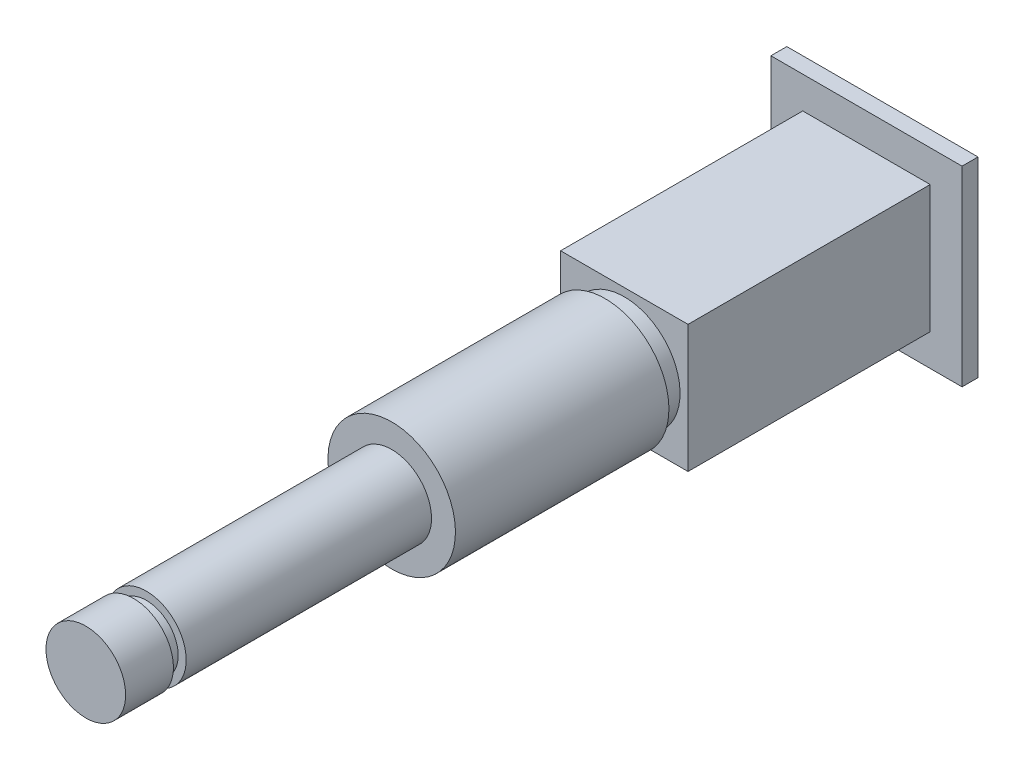
ISO-10303-21;
HEADER;
FILE_DESCRIPTION(('STEP AP214'),'2;1');
FILE_NAME('part.step','',(''),(''),'','','');
FILE_SCHEMA(('AUTOMOTIVE_DESIGN { 1 0 10303 214 1 1 1 1 }'));
ENDSEC;
DATA;
#1=APPLICATION_CONTEXT('core data for automotive mechanical design processes');
#2=APPLICATION_PROTOCOL_DEFINITION('international standard','automotive_design',2000,#1);
#3=PRODUCT_CONTEXT('',#1,'mechanical');
#4=PRODUCT('Part','Part','',(#3));
#5=PRODUCT_RELATED_PRODUCT_CATEGORY('part','',(#4));
#6=PRODUCT_DEFINITION_FORMATION('','',#4);
#7=PRODUCT_DEFINITION_CONTEXT('part definition',#1,'design');
#8=PRODUCT_DEFINITION('design','',#6,#7);
#9=PRODUCT_DEFINITION_SHAPE('','',#8);
#10=(LENGTH_UNIT() NAMED_UNIT(*) SI_UNIT(.MILLI.,.METRE.));
#11=(NAMED_UNIT(*) PLANE_ANGLE_UNIT() SI_UNIT($,.RADIAN.));
#12=(NAMED_UNIT(*) SI_UNIT($,.STERADIAN.) SOLID_ANGLE_UNIT());
#13=UNCERTAINTY_MEASURE_WITH_UNIT(LENGTH_MEASURE(1.E-05),#10,'distance_accuracy_value','');
#14=(GEOMETRIC_REPRESENTATION_CONTEXT(3) GLOBAL_UNCERTAINTY_ASSIGNED_CONTEXT((#13)) GLOBAL_UNIT_ASSIGNED_CONTEXT((#10,
#11,#12)) REPRESENTATION_CONTEXT('',''));
#15=CARTESIAN_POINT('',(0.,0.,0.));
#16=DIRECTION('',(0.,0.,1.));
#17=DIRECTION('',(1.,0.,0.));
#18=AXIS2_PLACEMENT_3D('',#15,#16,#17);
#19=CARTESIAN_POINT('',(0.,0.,19.2));
#20=DIRECTION('',(0.,0.,-1.));
#21=DIRECTION('',(0.,1.,0.));
#22=AXIS2_PLACEMENT_3D('',#19,#20,#21);
#23=PLANE('',#22);
#24=CARTESIAN_POINT('',(0.,0.,19.2));
#25=DIRECTION('',(0.,0.,1.));
#26=DIRECTION('',(0.,-1.,0.));
#27=AXIS2_PLACEMENT_3D('',#24,#25,#26);
#28=CIRCLE('',#27,2.5);
#29=CARTESIAN_POINT('',(0.,-2.5,19.2));
#30=VERTEX_POINT('',#29);
#31=EDGE_CURVE('E11',#30,#30,#28,.T.);
#32=ORIENTED_EDGE('',*,*,#31,.T.);
#33=EDGE_LOOP('',(#32));
#34=FACE_BOUND('',#33,.T.);
#35=ADVANCED_FACE('F37',(#34),#23,.F.);
#36=CARTESIAN_POINT('',(0.,0.,19.2));
#37=DIRECTION('',(0.,0.,1.));
#38=DIRECTION('',(0.,-1.,0.));
#39=AXIS2_PLACEMENT_3D('',#36,#37,#38);
#40=CYLINDRICAL_SURFACE('',#39,2.5);
#41=ORIENTED_EDGE('',*,*,#31,.F.);
#42=EDGE_LOOP('',(#41));
#43=FACE_BOUND('',#42,.T.);
#44=CARTESIAN_POINT('',(0.,0.,16.2));
#45=DIRECTION('',(0.,0.,1.));
#46=DIRECTION('',(0.,-1.,0.));
#47=AXIS2_PLACEMENT_3D('',#44,#45,#46);
#48=CIRCLE('',#47,2.5);
#49=CARTESIAN_POINT('',(0.,-2.5,16.2));
#50=VERTEX_POINT('',#49);
#51=EDGE_CURVE('E44',#50,#50,#48,.T.);
#52=ORIENTED_EDGE('',*,*,#51,.T.);
#53=EDGE_LOOP('',(#52));
#54=FACE_BOUND('',#53,.T.);
#55=ADVANCED_FACE('F194',(#43,#54),#40,.T.);
#56=CARTESIAN_POINT('',(0.,2.,16.2));
#57=DIRECTION('',(0.,0.,1.));
#58=DIRECTION('',(0.,-1.,0.));
#59=AXIS2_PLACEMENT_3D('',#56,#57,#58);
#60=PLANE('',#59);
#61=ORIENTED_EDGE('',*,*,#51,.F.);
#62=EDGE_LOOP('',(#61));
#63=FACE_BOUND('',#62,.T.);
#64=CARTESIAN_POINT('',(0.,0.,16.2));
#65=DIRECTION('',(0.,0.,1.));
#66=DIRECTION('',(0.,-1.,0.));
#67=AXIS2_PLACEMENT_3D('',#64,#65,#66);
#68=CIRCLE('',#67,2.);
#69=CARTESIAN_POINT('',(0.,-2.,16.2));
#70=VERTEX_POINT('',#69);
#71=EDGE_CURVE('E189',#70,#70,#68,.T.);
#72=ORIENTED_EDGE('',*,*,#71,.T.);
#73=EDGE_LOOP('',(#72));
#74=FACE_BOUND('',#73,.T.);
#75=ADVANCED_FACE('F196',(#63,#74),#60,.F.);
#76=CARTESIAN_POINT('',(0.,0.,19.2));
#77=DIRECTION('',(0.,0.,1.));
#78=DIRECTION('',(0.,-1.,0.));
#79=AXIS2_PLACEMENT_3D('',#76,#77,#78);
#80=CYLINDRICAL_SURFACE('',#79,2.);
#81=ORIENTED_EDGE('',*,*,#71,.F.);
#82=EDGE_LOOP('',(#81));
#83=FACE_BOUND('',#82,.T.);
#84=CARTESIAN_POINT('',(0.,0.,15.4));
#85=DIRECTION('',(0.,0.,1.));
#86=DIRECTION('',(0.,-1.,0.));
#87=AXIS2_PLACEMENT_3D('',#84,#85,#86);
#88=CIRCLE('',#87,2.);
#89=CARTESIAN_POINT('',(0.,-2.,15.4));
#90=VERTEX_POINT('',#89);
#91=EDGE_CURVE('E186',#90,#90,#88,.T.);
#92=ORIENTED_EDGE('',*,*,#91,.T.);
#93=EDGE_LOOP('',(#92));
#94=FACE_BOUND('',#93,.T.);
#95=ADVANCED_FACE('F199',(#83,#94),#80,.T.);
#96=CARTESIAN_POINT('',(0.,2.5,15.4));
#97=DIRECTION('',(0.,0.,-1.));
#98=DIRECTION('',(0.,1.,0.));
#99=AXIS2_PLACEMENT_3D('',#96,#97,#98);
#100=PLANE('',#99);
#101=ORIENTED_EDGE('',*,*,#91,.F.);
#102=EDGE_LOOP('',(#101));
#103=FACE_BOUND('',#102,.T.);
#104=CARTESIAN_POINT('',(0.,0.,15.4));
#105=DIRECTION('',(0.,0.,1.));
#106=DIRECTION('',(0.,-1.,0.));
#107=AXIS2_PLACEMENT_3D('',#104,#105,#106);
#108=CIRCLE('',#107,2.5);
#109=CARTESIAN_POINT('',(0.,-2.5,15.4));
#110=VERTEX_POINT('',#109);
#111=EDGE_CURVE('E183',#110,#110,#108,.T.);
#112=ORIENTED_EDGE('',*,*,#111,.T.);
#113=EDGE_LOOP('',(#112));
#114=FACE_BOUND('',#113,.T.);
#115=ADVANCED_FACE('F205',(#103,#114),#100,.F.);
#116=CARTESIAN_POINT('',(0.,0.,19.2));
#117=DIRECTION('',(0.,0.,1.));
#118=DIRECTION('',(0.,-1.,0.));
#119=AXIS2_PLACEMENT_3D('',#116,#117,#118);
#120=CYLINDRICAL_SURFACE('',#119,2.5);
#121=ORIENTED_EDGE('',*,*,#111,.F.);
#122=EDGE_LOOP('',(#121));
#123=FACE_BOUND('',#122,.T.);
#124=CARTESIAN_POINT('',(0.,0.,0.));
#125=DIRECTION('',(0.,0.,1.));
#126=DIRECTION('',(0.,-1.,0.));
#127=AXIS2_PLACEMENT_3D('',#124,#125,#126);
#128=CIRCLE('',#127,2.5);
#129=CARTESIAN_POINT('',(0.,-2.5,0.));
#130=VERTEX_POINT('',#129);
#131=EDGE_CURVE('E180',#130,#130,#128,.T.);
#132=ORIENTED_EDGE('',*,*,#131,.T.);
#133=EDGE_LOOP('',(#132));
#134=FACE_BOUND('',#133,.T.);
#135=ADVANCED_FACE('F211',(#123,#134),#120,.T.);
#136=CARTESIAN_POINT('',(0.,2.5,0.));
#137=DIRECTION('',(0.,0.,-1.));
#138=DIRECTION('',(0.,1.,0.));
#139=AXIS2_PLACEMENT_3D('',#136,#137,#138);
#140=PLANE('',#139);
#141=ORIENTED_EDGE('',*,*,#131,.F.);
#142=EDGE_LOOP('',(#141));
#143=FACE_BOUND('',#142,.T.);
#144=CARTESIAN_POINT('',(0.,0.,0.));
#145=DIRECTION('',(0.,0.,1.));
#146=DIRECTION('',(0.,-1.,0.));
#147=AXIS2_PLACEMENT_3D('',#144,#145,#146);
#148=CIRCLE('',#147,4.);
#149=CARTESIAN_POINT('',(0.,-4.,0.));
#150=VERTEX_POINT('',#149);
#151=EDGE_CURVE('E177',#150,#150,#148,.T.);
#152=ORIENTED_EDGE('',*,*,#151,.T.);
#153=EDGE_LOOP('',(#152));
#154=FACE_BOUND('',#153,.T.);
#155=ADVANCED_FACE('F217',(#143,#154),#140,.F.);
#156=CARTESIAN_POINT('',(0.,0.,19.2));
#157=DIRECTION('',(0.,0.,1.));
#158=DIRECTION('',(0.,-1.,0.));
#159=AXIS2_PLACEMENT_3D('',#156,#157,#158);
#160=CYLINDRICAL_SURFACE('',#159,4.);
#161=ORIENTED_EDGE('',*,*,#151,.F.);
#162=EDGE_LOOP('',(#161));
#163=FACE_BOUND('',#162,.T.);
#164=CARTESIAN_POINT('',(0.,0.,-13.4));
#165=DIRECTION('',(0.,0.,1.));
#166=DIRECTION('',(0.,-1.,0.));
#167=AXIS2_PLACEMENT_3D('',#164,#165,#166);
#168=CIRCLE('',#167,4.);
#169=CARTESIAN_POINT('',(0.,-4.,-13.4));
#170=VERTEX_POINT('',#169);
#171=EDGE_CURVE('E174',#170,#170,#168,.T.);
#172=ORIENTED_EDGE('',*,*,#171,.T.);
#173=EDGE_LOOP('',(#172));
#174=FACE_BOUND('',#173,.T.);
#175=ADVANCED_FACE('F223',(#163,#174),#160,.T.);
#176=CARTESIAN_POINT('',(0.,3.5,-13.4));
#177=DIRECTION('',(0.,0.,1.));
#178=DIRECTION('',(0.,-1.,0.));
#179=AXIS2_PLACEMENT_3D('',#176,#177,#178);
#180=PLANE('',#179);
#181=ORIENTED_EDGE('',*,*,#171,.F.);
#182=EDGE_LOOP('',(#181));
#183=FACE_BOUND('',#182,.T.);
#184=CARTESIAN_POINT('',(0.,0.,-13.4));
#185=DIRECTION('',(0.,0.,1.));
#186=DIRECTION('',(0.,-1.,0.));
#187=AXIS2_PLACEMENT_3D('',#184,#185,#186);
#188=CIRCLE('',#187,3.5);
#189=CARTESIAN_POINT('',(0.,-3.5,-13.4));
#190=VERTEX_POINT('',#189);
#191=EDGE_CURVE('E171',#190,#190,#188,.T.);
#192=ORIENTED_EDGE('',*,*,#191,.T.);
#193=EDGE_LOOP('',(#192));
#194=FACE_BOUND('',#193,.T.);
#195=ADVANCED_FACE('F229',(#183,#194),#180,.F.);
#196=CARTESIAN_POINT('',(0.,0.,19.2));
#197=DIRECTION('',(0.,0.,1.));
#198=DIRECTION('',(0.,-1.,0.));
#199=AXIS2_PLACEMENT_3D('',#196,#197,#198);
#200=CYLINDRICAL_SURFACE('',#199,3.5);
#201=ORIENTED_EDGE('',*,*,#191,.F.);
#202=EDGE_LOOP('',(#201));
#203=FACE_BOUND('',#202,.T.);
#204=CARTESIAN_POINT('',(0.,0.,-14.6));
#205=DIRECTION('',(0.,0.,1.));
#206=DIRECTION('',(0.,-1.,0.));
#207=AXIS2_PLACEMENT_3D('',#204,#205,#206);
#208=CIRCLE('',#207,3.5);
#209=CARTESIAN_POINT('',(0.,-3.5,-14.6));
#210=VERTEX_POINT('',#209);
#211=EDGE_CURVE('E145',#210,#210,#208,.T.);
#212=ORIENTED_EDGE('',*,*,#211,.T.);
#213=EDGE_LOOP('',(#212));
#214=FACE_BOUND('',#213,.T.);
#215=ADVANCED_FACE('F235',(#203,#214),#200,.T.);
#216=CARTESIAN_POINT('',(0.,4.,-14.6));
#217=DIRECTION('',(0.,0.,-1.));
#218=DIRECTION('',(0.,1.,0.));
#219=AXIS2_PLACEMENT_3D('',#216,#217,#218);
#220=PLANE('',#219);
#221=ORIENTED_EDGE('',*,*,#211,.F.);
#222=EDGE_LOOP('',(#221));
#223=FACE_BOUND('',#222,.T.);
#224=DIRECTION('',(-1.,0.,0.));
#225=VECTOR('',#224,1.);
#226=CARTESIAN_POINT('',(4.,-4.,-14.6));
#227=LINE('',#226,#225);
#228=CARTESIAN_POINT('',(4.,-4.,-14.6));
#229=VERTEX_POINT('',#228);
#230=CARTESIAN_POINT('',(-4.,-4.,-14.6));
#231=VERTEX_POINT('',#230);
#232=EDGE_CURVE('E51',#229,#231,#227,.T.);
#233=ORIENTED_EDGE('',*,*,#232,.F.);
#234=DIRECTION('',(0.,-1.,0.));
#235=VECTOR('',#234,1.);
#236=CARTESIAN_POINT('',(4.,-4.,-14.6));
#237=LINE('',#236,#235);
#238=CARTESIAN_POINT('',(4.,4.,-14.6));
#239=VERTEX_POINT('',#238);
#240=EDGE_CURVE('E140',#239,#229,#237,.T.);
#241=ORIENTED_EDGE('',*,*,#240,.F.);
#242=DIRECTION('',(1.,0.,0.));
#243=VECTOR('',#242,1.);
#244=CARTESIAN_POINT('',(4.,4.,-14.6));
#245=LINE('',#244,#243);
#246=CARTESIAN_POINT('',(-4.,4.,-14.6));
#247=VERTEX_POINT('',#246);
#248=EDGE_CURVE('E56',#247,#239,#245,.T.);
#249=ORIENTED_EDGE('',*,*,#248,.F.);
#250=DIRECTION('',(0.,1.,0.));
#251=VECTOR('',#250,1.);
#252=CARTESIAN_POINT('',(-4.,-4.,-14.6));
#253=LINE('',#252,#251);
#254=EDGE_CURVE('E143',#231,#247,#253,.T.);
#255=ORIENTED_EDGE('',*,*,#254,.F.);
#256=EDGE_LOOP('',(#233,#241,#249,#255));
#257=FACE_BOUND('',#256,.T.);
#258=ADVANCED_FACE('F241',(#223,#257),#220,.F.);
#259=CARTESIAN_POINT('',(4.,4.,-3.28629150101524));
#260=DIRECTION('',(0.,-1.,0.));
#261=DIRECTION('',(1.,0.,0.));
#262=AXIS2_PLACEMENT_3D('',#259,#260,#261);
#263=PLANE('',#262);
#264=DIRECTION('',(-1.,0.,0.));
#265=VECTOR('',#264,1.);
#266=CARTESIAN_POINT('',(4.,4.,-29.8));
#267=LINE('',#266,#265);
#268=CARTESIAN_POINT('',(4.,4.,-29.8));
#269=VERTEX_POINT('',#268);
#270=CARTESIAN_POINT('',(-4.,4.,-29.8));
#271=VERTEX_POINT('',#270);
#272=EDGE_CURVE('E153',#269,#271,#267,.T.);
#273=ORIENTED_EDGE('',*,*,#272,.T.);
#274=DIRECTION('',(0.,0.,-1.));
#275=VECTOR('',#274,1.);
#276=CARTESIAN_POINT('',(-4.,4.,-3.28629150101524));
#277=LINE('',#276,#275);
#278=EDGE_CURVE('E156',#247,#271,#277,.T.);
#279=ORIENTED_EDGE('',*,*,#278,.F.);
#280=ORIENTED_EDGE('',*,*,#248,.T.);
#281=DIRECTION('',(0.,0.,-1.));
#282=VECTOR('',#281,1.);
#283=CARTESIAN_POINT('',(4.,4.,-3.28629150101524));
#284=LINE('',#283,#282);
#285=EDGE_CURVE('E159',#239,#269,#284,.T.);
#286=ORIENTED_EDGE('',*,*,#285,.T.);
#287=EDGE_LOOP('',(#273,#279,#280,#286));
#288=FACE_BOUND('',#287,.T.);
#289=ADVANCED_FACE('F246',(#288),#263,.F.);
#290=CARTESIAN_POINT('',(4.,-4.,-3.28629150101524));
#291=DIRECTION('',(-1.,0.,0.));
#292=DIRECTION('',(0.,0.,1.));
#293=AXIS2_PLACEMENT_3D('',#290,#291,#292);
#294=PLANE('',#293);
#295=DIRECTION('',(0.,1.,0.));
#296=VECTOR('',#295,1.);
#297=CARTESIAN_POINT('',(4.,-4.,-29.8));
#298=LINE('',#297,#296);
#299=CARTESIAN_POINT('',(4.,-4.,-29.8));
#300=VERTEX_POINT('',#299);
#301=EDGE_CURVE('E151',#300,#269,#298,.T.);
#302=ORIENTED_EDGE('',*,*,#301,.T.);
#303=ORIENTED_EDGE('',*,*,#285,.F.);
#304=ORIENTED_EDGE('',*,*,#240,.T.);
#305=DIRECTION('',(0.,0.,-1.));
#306=VECTOR('',#305,1.);
#307=CARTESIAN_POINT('',(4.,-4.,-3.28629150101524));
#308=LINE('',#307,#306);
#309=EDGE_CURVE('E162',#229,#300,#308,.T.);
#310=ORIENTED_EDGE('',*,*,#309,.T.);
#311=EDGE_LOOP('',(#302,#303,#304,#310));
#312=FACE_BOUND('',#311,.T.);
#313=ADVANCED_FACE('F251',(#312),#294,.F.);
#314=CARTESIAN_POINT('',(4.,-4.,-3.28629150101524));
#315=DIRECTION('',(0.,1.,0.));
#316=DIRECTION('',(-1.,0.,0.));
#317=AXIS2_PLACEMENT_3D('',#314,#315,#316);
#318=PLANE('',#317);
#319=DIRECTION('',(1.,0.,0.));
#320=VECTOR('',#319,1.);
#321=CARTESIAN_POINT('',(4.,-4.,-29.8));
#322=LINE('',#321,#320);
#323=CARTESIAN_POINT('',(-4.,-4.,-29.8));
#324=VERTEX_POINT('',#323);
#325=EDGE_CURVE('E148',#324,#300,#322,.T.);
#326=ORIENTED_EDGE('',*,*,#325,.T.);
#327=ORIENTED_EDGE('',*,*,#309,.F.);
#328=ORIENTED_EDGE('',*,*,#232,.T.);
#329=DIRECTION('',(0.,0.,-1.));
#330=VECTOR('',#329,1.);
#331=CARTESIAN_POINT('',(-4.,-4.,-3.28629150101524));
#332=LINE('',#331,#330);
#333=EDGE_CURVE('E165',#231,#324,#332,.T.);
#334=ORIENTED_EDGE('',*,*,#333,.T.);
#335=EDGE_LOOP('',(#326,#327,#328,#334));
#336=FACE_BOUND('',#335,.T.);
#337=ADVANCED_FACE('F319',(#336),#318,.F.);
#338=CARTESIAN_POINT('',(-4.,-4.,-3.28629150101524));
#339=DIRECTION('',(1.,0.,0.));
#340=DIRECTION('',(0.,0.,-1.));
#341=AXIS2_PLACEMENT_3D('',#338,#339,#340);
#342=PLANE('',#341);
#343=DIRECTION('',(0.,-1.,0.));
#344=VECTOR('',#343,1.);
#345=CARTESIAN_POINT('',(-4.,-4.,-29.8));
#346=LINE('',#345,#344);
#347=EDGE_CURVE('E139',#271,#324,#346,.T.);
#348=ORIENTED_EDGE('',*,*,#347,.T.);
#349=ORIENTED_EDGE('',*,*,#333,.F.);
#350=ORIENTED_EDGE('',*,*,#254,.T.);
#351=ORIENTED_EDGE('',*,*,#278,.T.);
#352=EDGE_LOOP('',(#348,#349,#350,#351));
#353=FACE_BOUND('',#352,.T.);
#354=ADVANCED_FACE('F330',(#353),#342,.F.);
#355=CARTESIAN_POINT('',(0.,4.,-29.8));
#356=DIRECTION('',(0.,0.,-1.));
#357=DIRECTION('',(0.,1.,0.));
#358=AXIS2_PLACEMENT_3D('',#355,#356,#357);
#359=PLANE('',#358);
#360=ORIENTED_EDGE('',*,*,#347,.F.);
#361=ORIENTED_EDGE('',*,*,#272,.F.);
#362=ORIENTED_EDGE('',*,*,#301,.F.);
#363=ORIENTED_EDGE('',*,*,#325,.F.);
#364=EDGE_LOOP('',(#360,#361,#362,#363));
#365=FACE_BOUND('',#364,.T.);
#366=DIRECTION('',(0.,1.,0.));
#367=VECTOR('',#366,1.);
#368=CARTESIAN_POINT('',(6.,-6.,-29.8));
#369=LINE('',#368,#367);
#370=CARTESIAN_POINT('',(6.,-6.,-29.8));
#371=VERTEX_POINT('',#370);
#372=CARTESIAN_POINT('',(6.,6.,-29.8));
#373=VERTEX_POINT('',#372);
#374=EDGE_CURVE('E108',#371,#373,#369,.T.);
#375=ORIENTED_EDGE('',*,*,#374,.T.);
#376=DIRECTION('',(-1.,0.,0.));
#377=VECTOR('',#376,1.);
#378=CARTESIAN_POINT('',(-6.,6.,-29.8));
#379=LINE('',#378,#377);
#380=CARTESIAN_POINT('',(-6.,6.,-29.8));
#381=VERTEX_POINT('',#380);
#382=EDGE_CURVE('E466',#373,#381,#379,.T.);
#383=ORIENTED_EDGE('',*,*,#382,.T.);
#384=DIRECTION('',(0.,-1.,0.));
#385=VECTOR('',#384,1.);
#386=CARTESIAN_POINT('',(-6.,-6.,-29.8));
#387=LINE('',#386,#385);
#388=CARTESIAN_POINT('',(-6.,-6.,-29.8));
#389=VERTEX_POINT('',#388);
#390=EDGE_CURVE('E133',#381,#389,#387,.T.);
#391=ORIENTED_EDGE('',*,*,#390,.T.);
#392=DIRECTION('',(1.,0.,0.));
#393=VECTOR('',#392,1.);
#394=CARTESIAN_POINT('',(-6.,-6.,-29.8));
#395=LINE('',#394,#393);
#396=EDGE_CURVE('E137',#389,#371,#395,.T.);
#397=ORIENTED_EDGE('',*,*,#396,.T.);
#398=EDGE_LOOP('',(#375,#383,#391,#397));
#399=FACE_BOUND('',#398,.T.);
#400=ADVANCED_FACE('F341',(#365,#399),#359,.F.);
#401=CARTESIAN_POINT('',(6.,-6.,-12.8294372515229));
#402=DIRECTION('',(1.,0.,0.));
#403=DIRECTION('',(0.,0.,-1.));
#404=AXIS2_PLACEMENT_3D('',#401,#402,#403);
#405=PLANE('',#404);
#406=ORIENTED_EDGE('',*,*,#374,.F.);
#407=DIRECTION('',(0.,0.,-1.));
#408=VECTOR('',#407,1.);
#409=CARTESIAN_POINT('',(6.,-6.,-12.8294372515229));
#410=LINE('',#409,#408);
#411=CARTESIAN_POINT('',(6.,-6.,-30.8));
#412=VERTEX_POINT('',#411);
#413=EDGE_CURVE('E101',#371,#412,#410,.T.);
#414=ORIENTED_EDGE('',*,*,#413,.T.);
#415=DIRECTION('',(0.,-1.,0.));
#416=VECTOR('',#415,1.);
#417=CARTESIAN_POINT('',(6.,-6.,-30.8));
#418=LINE('',#417,#416);
#419=CARTESIAN_POINT('',(6.,6.,-30.8));
#420=VERTEX_POINT('',#419);
#421=EDGE_CURVE('E106',#420,#412,#418,.T.);
#422=ORIENTED_EDGE('',*,*,#421,.F.);
#423=DIRECTION('',(0.,0.,-1.));
#424=VECTOR('',#423,1.);
#425=CARTESIAN_POINT('',(6.,6.,-12.8294372515229));
#426=LINE('',#425,#424);
#427=EDGE_CURVE('E131',#373,#420,#426,.T.);
#428=ORIENTED_EDGE('',*,*,#427,.F.);
#429=EDGE_LOOP('',(#406,#414,#422,#428));
#430=FACE_BOUND('',#429,.T.);
#431=ADVANCED_FACE('F103',(#430),#405,.T.);
#432=CARTESIAN_POINT('',(-6.,6.,-12.8294372515229));
#433=DIRECTION('',(0.,1.,0.));
#434=DIRECTION('',(-1.,0.,0.));
#435=AXIS2_PLACEMENT_3D('',#432,#433,#434);
#436=PLANE('',#435);
#437=ORIENTED_EDGE('',*,*,#382,.F.);
#438=ORIENTED_EDGE('',*,*,#427,.T.);
#439=DIRECTION('',(1.,0.,0.));
#440=VECTOR('',#439,1.);
#441=CARTESIAN_POINT('',(-6.,6.,-30.8));
#442=LINE('',#441,#440);
#443=CARTESIAN_POINT('',(-6.,6.,-30.8));
#444=VERTEX_POINT('',#443);
#445=EDGE_CURVE('E112',#444,#420,#442,.T.);
#446=ORIENTED_EDGE('',*,*,#445,.F.);
#447=DIRECTION('',(0.,0.,-1.));
#448=VECTOR('',#447,1.);
#449=CARTESIAN_POINT('',(-6.,6.,-12.8294372515229));
#450=LINE('',#449,#448);
#451=EDGE_CURVE('E134',#381,#444,#450,.T.);
#452=ORIENTED_EDGE('',*,*,#451,.F.);
#453=EDGE_LOOP('',(#437,#438,#446,#452));
#454=FACE_BOUND('',#453,.T.);
#455=ADVANCED_FACE('F361',(#454),#436,.T.);
#456=CARTESIAN_POINT('',(-6.,-6.,-12.8294372515229));
#457=DIRECTION('',(-1.,0.,0.));
#458=DIRECTION('',(0.,-1.,0.));
#459=AXIS2_PLACEMENT_3D('',#456,#457,#458);
#460=PLANE('',#459);
#461=ORIENTED_EDGE('',*,*,#390,.F.);
#462=ORIENTED_EDGE('',*,*,#451,.T.);
#463=DIRECTION('',(0.,1.,0.));
#464=VECTOR('',#463,1.);
#465=CARTESIAN_POINT('',(-6.,-6.,-30.8));
#466=LINE('',#465,#464);
#467=CARTESIAN_POINT('',(-6.,-6.,-30.8));
#468=VERTEX_POINT('',#467);
#469=EDGE_CURVE('E121',#468,#444,#466,.T.);
#470=ORIENTED_EDGE('',*,*,#469,.F.);
#471=DIRECTION('',(0.,0.,-1.));
#472=VECTOR('',#471,1.);
#473=CARTESIAN_POINT('',(-6.,-6.,-12.8294372515229));
#474=LINE('',#473,#472);
#475=EDGE_CURVE('E111',#389,#468,#474,.T.);
#476=ORIENTED_EDGE('',*,*,#475,.F.);
#477=EDGE_LOOP('',(#461,#462,#470,#476));
#478=FACE_BOUND('',#477,.T.);
#479=ADVANCED_FACE('F371',(#478),#460,.T.);
#480=CARTESIAN_POINT('',(-6.,-6.,-12.8294372515229));
#481=DIRECTION('',(0.,-1.,0.));
#482=DIRECTION('',(1.,0.,0.));
#483=AXIS2_PLACEMENT_3D('',#480,#481,#482);
#484=PLANE('',#483);
#485=ORIENTED_EDGE('',*,*,#396,.F.);
#486=ORIENTED_EDGE('',*,*,#475,.T.);
#487=DIRECTION('',(-1.,0.,0.));
#488=VECTOR('',#487,1.);
#489=CARTESIAN_POINT('',(-6.,-6.,-30.8));
#490=LINE('',#489,#488);
#491=EDGE_CURVE('E115',#412,#468,#490,.T.);
#492=ORIENTED_EDGE('',*,*,#491,.F.);
#493=ORIENTED_EDGE('',*,*,#413,.F.);
#494=EDGE_LOOP('',(#485,#486,#492,#493));
#495=FACE_BOUND('',#494,.T.);
#496=ADVANCED_FACE('F116',(#495),#484,.T.);
#497=CARTESIAN_POINT('',(0.,5.,-30.8));
#498=DIRECTION('',(0.,0.,1.));
#499=DIRECTION('',(0.,-1.,0.));
#500=AXIS2_PLACEMENT_3D('',#497,#498,#499);
#501=PLANE('',#500);
#502=ORIENTED_EDGE('',*,*,#421,.T.);
#503=ORIENTED_EDGE('',*,*,#491,.T.);
#504=ORIENTED_EDGE('',*,*,#469,.T.);
#505=ORIENTED_EDGE('',*,*,#445,.T.);
#506=EDGE_LOOP('',(#502,#503,#504,#505));
#507=FACE_BOUND('',#506,.T.);
#508=ADVANCED_FACE('F123',(#507),#501,.F.);
#509=CLOSED_SHELL('',(#35,#55,#75,#95,#115,#135,#155,#175,#195,#215,#258,#289,#313,#337,#354,
#400,#431,#455,#479,#496,#508));
#510=MANIFOLD_SOLID_BREP('B2',#509);
#511=ADVANCED_BREP_SHAPE_REPRESENTATION('',(#18,#510),#14);
#512=SHAPE_DEFINITION_REPRESENTATION(#9,#511);
ENDSEC;
END-ISO-10303-21;
